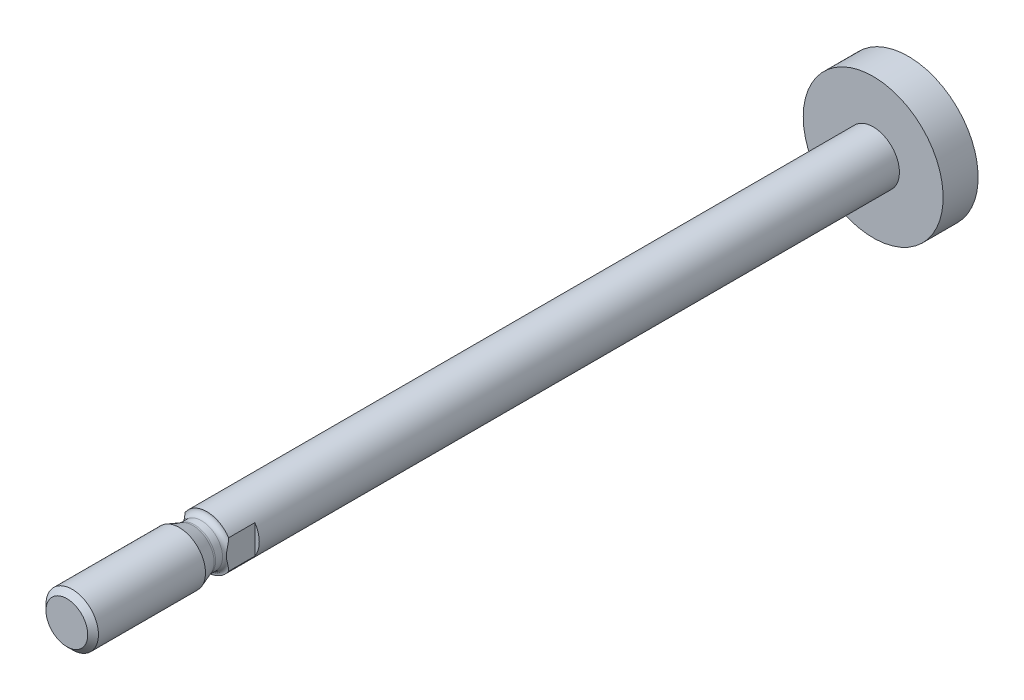
ISO-10303-21;
HEADER;
FILE_DESCRIPTION(('STEP AP214'),'2;1');
FILE_NAME('part.step','',(''),(''),'','','');
FILE_SCHEMA(('AUTOMOTIVE_DESIGN { 1 0 10303 214 1 1 1 1 }'));
ENDSEC;
DATA;
#1=APPLICATION_CONTEXT('core data for automotive mechanical design processes');
#2=APPLICATION_PROTOCOL_DEFINITION('international standard','automotive_design',2000,#1);
#3=PRODUCT_CONTEXT('',#1,'mechanical');
#4=PRODUCT('Part','Part','',(#3));
#5=PRODUCT_RELATED_PRODUCT_CATEGORY('part','',(#4));
#6=PRODUCT_DEFINITION_FORMATION('','',#4);
#7=PRODUCT_DEFINITION_CONTEXT('part definition',#1,'design');
#8=PRODUCT_DEFINITION('design','',#6,#7);
#9=PRODUCT_DEFINITION_SHAPE('','',#8);
#10=(LENGTH_UNIT() NAMED_UNIT(*) SI_UNIT(.MILLI.,.METRE.));
#11=(NAMED_UNIT(*) PLANE_ANGLE_UNIT() SI_UNIT($,.RADIAN.));
#12=(NAMED_UNIT(*) SI_UNIT($,.STERADIAN.) SOLID_ANGLE_UNIT());
#13=UNCERTAINTY_MEASURE_WITH_UNIT(LENGTH_MEASURE(1.E-05),#10,'distance_accuracy_value','');
#14=(GEOMETRIC_REPRESENTATION_CONTEXT(3) GLOBAL_UNCERTAINTY_ASSIGNED_CONTEXT((#13)) GLOBAL_UNIT_ASSIGNED_CONTEXT((#10,
#11,#12)) REPRESENTATION_CONTEXT('',''));
#15=CARTESIAN_POINT('',(0.,0.,0.));
#16=DIRECTION('',(0.,0.,1.));
#17=DIRECTION('',(1.,0.,0.));
#18=AXIS2_PLACEMENT_3D('',#15,#16,#17);
#19=CARTESIAN_POINT('',(0.,0.,-75.2));
#20=DIRECTION('',(0.,0.,-1.));
#21=DIRECTION('',(-1.,0.,0.));
#22=AXIS2_PLACEMENT_3D('',#19,#20,#21);
#23=CYLINDRICAL_SURFACE('',#22,3.);
#24=CARTESIAN_POINT('',(0.,0.,-71.2));
#25=DIRECTION('',(0.,0.,-1.));
#26=DIRECTION('',(-1.,0.,0.));
#27=AXIS2_PLACEMENT_3D('',#24,#25,#26);
#28=CIRCLE('',#27,3.);
#29=CARTESIAN_POINT('',(-3.,0.,-71.2));
#30=VERTEX_POINT('',#29);
#31=EDGE_CURVE('E80',#30,#30,#28,.T.);
#32=ORIENTED_EDGE('',*,*,#31,.F.);
#33=EDGE_LOOP('',(#32));
#34=FACE_BOUND('',#33,.T.);
#35=DIRECTION('',(0.,0.,-1.));
#36=VECTOR('',#35,1.);
#37=CARTESIAN_POINT('',(-2.5,1.6583123951777,4.99999999999909));
#38=LINE('',#37,#36);
#39=CARTESIAN_POINT('',(-2.5,1.65831239517778,4.99999999999909));
#40=VERTEX_POINT('',#39);
#41=CARTESIAN_POINT('',(-2.5,1.6583123951777,2.));
#42=VERTEX_POINT('',#41);
#43=EDGE_CURVE('E69',#40,#42,#38,.T.);
#44=ORIENTED_EDGE('',*,*,#43,.F.);
#45=CARTESIAN_POINT('',(0.,0.,5.));
#46=DIRECTION('',(0.,0.,-1.));
#47=DIRECTION('',(-0.833333333333321,0.552770798392585,0.));
#48=AXIS2_PLACEMENT_3D('',#45,#46,#47);
#49=CIRCLE('',#48,3.);
#50=CARTESIAN_POINT('',(2.5,1.6583123951777,5.));
#51=VERTEX_POINT('',#50);
#52=EDGE_CURVE('E55',#40,#51,#49,.T.);
#53=ORIENTED_EDGE('',*,*,#52,.T.);
#54=DIRECTION('',(0.,0.,1.));
#55=VECTOR('',#54,1.);
#56=CARTESIAN_POINT('',(2.5,1.6583123951777,2.));
#57=LINE('',#56,#55);
#58=CARTESIAN_POINT('',(2.5,1.6583123951777,2.));
#59=VERTEX_POINT('',#58);
#60=EDGE_CURVE('E68',#59,#51,#57,.T.);
#61=ORIENTED_EDGE('',*,*,#60,.F.);
#62=CARTESIAN_POINT('',(0.,0.,2.));
#63=DIRECTION('',(0.,0.,1.));
#64=DIRECTION('',(0.833333333333333,-0.552770798392567,0.));
#65=AXIS2_PLACEMENT_3D('',#62,#63,#64);
#66=CIRCLE('',#65,3.);
#67=CARTESIAN_POINT('',(2.5,-1.6583123951777,2.));
#68=VERTEX_POINT('',#67);
#69=EDGE_CURVE('E90',#68,#59,#66,.T.);
#70=ORIENTED_EDGE('',*,*,#69,.F.);
#71=DIRECTION('',(0.,0.,-1.));
#72=VECTOR('',#71,1.);
#73=CARTESIAN_POINT('',(2.5,-1.6583123951777,4.99999999999909));
#74=LINE('',#73,#72);
#75=CARTESIAN_POINT('',(2.5,-1.65831239517778,4.99999999999909));
#76=VERTEX_POINT('',#75);
#77=EDGE_CURVE('E94',#76,#68,#74,.T.);
#78=ORIENTED_EDGE('',*,*,#77,.F.);
#79=CARTESIAN_POINT('',(0.,0.,5.));
#80=DIRECTION('',(0.,0.,-1.));
#81=DIRECTION('',(0.833333333333321,-0.552770798392585,0.));
#82=AXIS2_PLACEMENT_3D('',#79,#80,#81);
#83=CIRCLE('',#82,3.);
#84=CARTESIAN_POINT('',(-2.5,-1.6583123951777,5.));
#85=VERTEX_POINT('',#84);
#86=EDGE_CURVE('E99',#76,#85,#83,.T.);
#87=ORIENTED_EDGE('',*,*,#86,.T.);
#88=DIRECTION('',(0.,0.,1.));
#89=VECTOR('',#88,1.);
#90=CARTESIAN_POINT('',(-2.5,-1.6583123951777,2.));
#91=LINE('',#90,#89);
#92=CARTESIAN_POINT('',(-2.5,-1.6583123951777,2.));
#93=VERTEX_POINT('',#92);
#94=EDGE_CURVE('E77',#93,#85,#91,.T.);
#95=ORIENTED_EDGE('',*,*,#94,.F.);
#96=CARTESIAN_POINT('',(0.,0.,2.));
#97=DIRECTION('',(0.,0.,1.));
#98=DIRECTION('',(-0.833333333333333,0.552770798392567,0.));
#99=AXIS2_PLACEMENT_3D('',#96,#97,#98);
#100=CIRCLE('',#99,3.);
#101=EDGE_CURVE('E34',#42,#93,#100,.T.);
#102=ORIENTED_EDGE('',*,*,#101,.F.);
#103=EDGE_LOOP('',(#44,#53,#61,#70,#78,#87,#95,#102));
#104=FACE_BOUND('',#103,.T.);
#105=ADVANCED_FACE('F17',(#34,#104),#23,.T.);
#106=CARTESIAN_POINT('',(0.,3.,-71.2));
#107=DIRECTION('',(0.,0.,-1.));
#108=DIRECTION('',(-1.,0.,0.));
#109=AXIS2_PLACEMENT_3D('',#106,#107,#108);
#110=PLANE('',#109);
#111=CARTESIAN_POINT('',(0.,0.,-71.2));
#112=DIRECTION('',(0.,0.,-1.));
#113=DIRECTION('',(-1.,0.,0.));
#114=AXIS2_PLACEMENT_3D('',#111,#112,#113);
#115=CIRCLE('',#114,8.);
#116=CARTESIAN_POINT('',(-8.,0.,-71.2));
#117=VERTEX_POINT('',#116);
#118=EDGE_CURVE('E109',#117,#117,#115,.T.);
#119=ORIENTED_EDGE('',*,*,#118,.F.);
#120=EDGE_LOOP('',(#119));
#121=FACE_BOUND('',#120,.T.);
#122=ORIENTED_EDGE('',*,*,#31,.T.);
#123=EDGE_LOOP('',(#122));
#124=FACE_BOUND('',#123,.T.);
#125=ADVANCED_FACE('F119',(#121,#124),#110,.F.);
#126=CARTESIAN_POINT('',(-2.5,-5.,6.));
#127=DIRECTION('',(-1.,0.,0.));
#128=DIRECTION('',(0.,0.,1.));
#129=AXIS2_PLACEMENT_3D('',#126,#127,#128);
#130=PLANE('',#129);
#131=ORIENTED_EDGE('',*,*,#43,.T.);
#132=DIRECTION('',(0.,1.,0.));
#133=VECTOR('',#132,1.);
#134=CARTESIAN_POINT('',(-2.5,-1.6583123951777,2.));
#135=LINE('',#134,#133);
#136=EDGE_CURVE('E31',#93,#42,#135,.T.);
#137=ORIENTED_EDGE('',*,*,#136,.F.);
#138=ORIENTED_EDGE('',*,*,#94,.T.);
#139=CARTESIAN_POINT('',(-2.5,-1.65831829169541,5.00000000000885));
#140=CARTESIAN_POINT('',(-2.5,-1.63491532877898,4.99999992973286));
#141=CARTESIAN_POINT('',(-2.5,-1.61149482046343,5.00041875125078));
#142=CARTESIAN_POINT('',(-2.5,-1.45329985222676,5.00583269208804));
#143=CARTESIAN_POINT('',(-2.5,-1.32008048780736,5.02291400118435));
#144=CARTESIAN_POINT('',(-2.5,-1.05526955750932,5.07061231229032));
#145=CARTESIAN_POINT('',(-2.5,-0.924587612317244,5.10126759833291));
#146=CARTESIAN_POINT('',(-2.5,-0.663403044787274,5.16510709196525));
#147=CARTESIAN_POINT('',(-2.5,-0.532955207719693,5.19852985989759));
#148=CARTESIAN_POINT('',(-2.5,-0.3351050647231,5.2375995275498));
#149=CARTESIAN_POINT('',(-2.5,-0.269167347488754,5.24862076501824));
#150=CARTESIAN_POINT('',(-2.5,-0.135243346078244,5.26407313721784));
#151=CARTESIAN_POINT('',(-2.5,-0.0659370163481887,5.26833752096453));
#152=CARTESIAN_POINT('',(-2.5,0.105328995263471,5.26833752096453));
#153=CARTESIAN_POINT('',(-2.5,0.204452731333742,5.25835623262265));
#154=CARTESIAN_POINT('',(-2.5,0.406625741882635,5.22538789194667));
#155=CARTESIAN_POINT('',(-2.5,0.506215999796735,5.20297777521126));
#156=CARTESIAN_POINT('',(-2.5,0.779290928519066,5.1376308856199));
#157=CARTESIAN_POINT('',(-2.5,0.952215632476059,5.09230978675975));
#158=CARTESIAN_POINT('',(-2.5,1.30286487229559,5.02381276997557));
#159=CARTESIAN_POINT('',(-2.5,1.47927159521248,4.9999999503834));
#160=CARTESIAN_POINT('',(-2.5,1.65831293934871,5.00000000000008));
#161=B_SPLINE_CURVE_WITH_KNOTS('',3,(#139,#140,#141,#142,#143,#144,#145,#146,#147,#148,#149,
#150,#151,#152,#153,#154,#155,#156,#157,#158,#159,#160),.UNSPECIFIED.,.F.,.F.,(4,2,2,2,2,2,2,2,
2,2,4),(9.64041016296276,9.70681215541733,10.0900053470554,10.4731985386934,10.8564820300666,
11.0481237757532,11.2397655214398,11.5458975492694,11.852029577099,12.3859060442365,
12.919782511374),.UNSPECIFIED.);
#162=EDGE_CURVE('E60',#85,#40,#161,.T.);
#163=ORIENTED_EDGE('',*,*,#162,.T.);
#164=EDGE_LOOP('',(#131,#137,#138,#163));
#165=FACE_BOUND('',#164,.T.);
#166=ADVANCED_FACE('F75',(#165),#130,.T.);
#167=CARTESIAN_POINT('',(0.,0.,5.6000000000001));
#168=DIRECTION('',(0.,0.,-1.));
#169=DIRECTION('',(-1.,0.,0.));
#170=AXIS2_PLACEMENT_3D('',#167,#168,#169);
#171=TOROIDAL_SURFACE('',#170,3.0000000000001,0.600000000000099);
#172=ORIENTED_EDGE('',*,*,#52,.F.);
#173=ORIENTED_EDGE('',*,*,#162,.F.);
#174=ORIENTED_EDGE('',*,*,#86,.F.);
#175=CARTESIAN_POINT('',(2.5,1.65831829169541,5.00000000000885));
#176=CARTESIAN_POINT('',(2.5,1.63491532877898,4.99999992973286));
#177=CARTESIAN_POINT('',(2.5,1.61149482046343,5.00041875125078));
#178=CARTESIAN_POINT('',(2.5,1.45329985222676,5.00583269208804));
#179=CARTESIAN_POINT('',(2.5,1.32008048780736,5.02291400118435));
#180=CARTESIAN_POINT('',(2.5,1.05526955750931,5.07061231229032));
#181=CARTESIAN_POINT('',(2.5,0.924587612317241,5.10126759833291));
#182=CARTESIAN_POINT('',(2.5,0.663403044787271,5.16510709196525));
#183=CARTESIAN_POINT('',(2.5,0.532955207719693,5.19852985989759));
#184=CARTESIAN_POINT('',(2.5,0.335105064723101,5.2375995275498));
#185=CARTESIAN_POINT('',(2.5,0.269167347488754,5.24862076501824));
#186=CARTESIAN_POINT('',(2.5,0.135243346078244,5.26407313721784));
#187=CARTESIAN_POINT('',(2.5,0.065937016348187,5.26833752096453));
#188=CARTESIAN_POINT('',(2.5,-0.105328995263471,5.26833752096453));
#189=CARTESIAN_POINT('',(2.5,-0.204452731333741,5.25835623262266));
#190=CARTESIAN_POINT('',(2.5,-0.406625741882635,5.22538789194667));
#191=CARTESIAN_POINT('',(2.5,-0.506215999796737,5.20297777521126));
#192=CARTESIAN_POINT('',(2.5,-0.779290928519067,5.1376308856199));
#193=CARTESIAN_POINT('',(2.5,-0.95221563247606,5.09230978675975));
#194=CARTESIAN_POINT('',(2.5,-1.30286487229559,5.02381276997557));
#195=CARTESIAN_POINT('',(2.5,-1.47927159521248,4.9999999503834));
#196=CARTESIAN_POINT('',(2.5,-1.65831293934871,5.00000000000008));
#197=B_SPLINE_CURVE_WITH_KNOTS('',3,(#175,#176,#177,#178,#179,#180,#181,#182,#183,#184,#185,
#186,#187,#188,#189,#190,#191,#192,#193,#194,#195,#196),.UNSPECIFIED.,.F.,.F.,(4,2,2,2,2,2,2,2,
2,2,4),(9.64041016296277,9.70681215541734,10.0900053470554,10.4731985386934,10.8564820300666,
11.0481237757532,11.2397655214398,11.5458975492694,11.852029577099,12.3859060442365,
12.9197825113741),.UNSPECIFIED.);
#198=EDGE_CURVE('E63',#51,#76,#197,.T.);
#199=ORIENTED_EDGE('',*,*,#198,.F.);
#200=EDGE_LOOP('',(#172,#173,#174,#199));
#201=FACE_BOUND('',#200,.T.);
#202=CARTESIAN_POINT('',(0.,0.,5.6));
#203=DIRECTION('',(0.,0.,-1.));
#204=DIRECTION('',(-1.,0.,0.));
#205=AXIS2_PLACEMENT_3D('',#202,#203,#204);
#206=CIRCLE('',#205,2.4);
#207=CARTESIAN_POINT('',(-2.4,0.,5.6));
#208=VERTEX_POINT('',#207);
#209=EDGE_CURVE('E155',#208,#208,#206,.T.);
#210=ORIENTED_EDGE('',*,*,#209,.T.);
#211=EDGE_LOOP('',(#210));
#212=FACE_BOUND('',#211,.T.);
#213=ADVANCED_FACE('F57',(#201,#212),#171,.F.);
#214=CARTESIAN_POINT('',(2.5,5.,6.));
#215=DIRECTION('',(1.,0.,0.));
#216=DIRECTION('',(0.,0.,-1.));
#217=AXIS2_PLACEMENT_3D('',#214,#215,#216);
#218=PLANE('',#217);
#219=ORIENTED_EDGE('',*,*,#77,.T.);
#220=DIRECTION('',(0.,-1.,0.));
#221=VECTOR('',#220,1.);
#222=CARTESIAN_POINT('',(2.5,1.6583123951777,2.));
#223=LINE('',#222,#221);
#224=EDGE_CURVE('E163',#59,#68,#223,.T.);
#225=ORIENTED_EDGE('',*,*,#224,.F.);
#226=ORIENTED_EDGE('',*,*,#60,.T.);
#227=ORIENTED_EDGE('',*,*,#198,.T.);
#228=EDGE_LOOP('',(#219,#225,#226,#227));
#229=FACE_BOUND('',#228,.T.);
#230=ADVANCED_FACE('F175',(#229),#218,.T.);
#231=CARTESIAN_POINT('',(0.,0.,2.));
#232=DIRECTION('',(0.,0.,1.));
#233=DIRECTION('',(1.,0.,0.));
#234=AXIS2_PLACEMENT_3D('',#231,#232,#233);
#235=PLANE('',#234);
#236=ORIENTED_EDGE('',*,*,#69,.T.);
#237=ORIENTED_EDGE('',*,*,#224,.T.);
#238=EDGE_LOOP('',(#236,#237));
#239=FACE_BOUND('',#238,.T.);
#240=ADVANCED_FACE('F184',(#239),#235,.T.);
#241=ORIENTED_EDGE('',*,*,#101,.T.);
#242=ORIENTED_EDGE('',*,*,#136,.T.);
#243=EDGE_LOOP('',(#241,#242));
#244=FACE_BOUND('',#243,.T.);
#245=ADVANCED_FACE('F187',(#244),#235,.T.);
#246=CARTESIAN_POINT('',(0.,0.,-75.2));
#247=DIRECTION('',(0.,0.,-1.));
#248=DIRECTION('',(-1.,0.,0.));
#249=AXIS2_PLACEMENT_3D('',#246,#247,#248);
#250=CYLINDRICAL_SURFACE('',#249,8.);
#251=CARTESIAN_POINT('',(0.,0.,-75.2));
#252=DIRECTION('',(0.,0.,-1.));
#253=DIRECTION('',(-1.,0.,0.));
#254=AXIS2_PLACEMENT_3D('',#251,#252,#253);
#255=CIRCLE('',#254,8.);
#256=CARTESIAN_POINT('',(-8.,0.,-75.2));
#257=VERTEX_POINT('',#256);
#258=EDGE_CURVE('E165',#257,#257,#255,.T.);
#259=ORIENTED_EDGE('',*,*,#258,.F.);
#260=EDGE_LOOP('',(#259));
#261=FACE_BOUND('',#260,.T.);
#262=ORIENTED_EDGE('',*,*,#118,.T.);
#263=EDGE_LOOP('',(#262));
#264=FACE_BOUND('',#263,.T.);
#265=ADVANCED_FACE('F117',(#261,#264),#250,.T.);
#266=CARTESIAN_POINT('',(0.,0.,4.));
#267=DIRECTION('',(0.,0.,-1.));
#268=DIRECTION('',(-1.,0.,0.));
#269=AXIS2_PLACEMENT_3D('',#266,#267,#268);
#270=CYLINDRICAL_SURFACE('',#269,2.4);
#271=ORIENTED_EDGE('',*,*,#209,.F.);
#272=EDGE_LOOP('',(#271));
#273=FACE_BOUND('',#272,.T.);
#274=CARTESIAN_POINT('',(0.,0.,6.3942038115749));
#275=DIRECTION('',(0.,0.,-1.));
#276=DIRECTION('',(-1.,0.,0.));
#277=AXIS2_PLACEMENT_3D('',#274,#275,#276);
#278=CIRCLE('',#277,2.4);
#279=CARTESIAN_POINT('',(-2.4,0.,6.3942038115749));
#280=VERTEX_POINT('',#279);
#281=EDGE_CURVE('E229',#280,#280,#278,.T.);
#282=ORIENTED_EDGE('',*,*,#281,.T.);
#283=EDGE_LOOP('',(#282));
#284=FACE_BOUND('',#283,.T.);
#285=ADVANCED_FACE('F191',(#273,#284),#270,.T.);
#286=CARTESIAN_POINT('',(0.,8.,-75.2));
#287=DIRECTION('',(0.,0.,1.));
#288=DIRECTION('',(1.,0.,0.));
#289=AXIS2_PLACEMENT_3D('',#286,#287,#288);
#290=PLANE('',#289);
#291=ORIENTED_EDGE('',*,*,#258,.T.);
#292=EDGE_LOOP('',(#291));
#293=FACE_BOUND('',#292,.T.);
#294=ADVANCED_FACE('F195',(#293),#290,.F.);
#295=CARTESIAN_POINT('',(0.,0.,6.39420381157483));
#296=DIRECTION('',(0.,0.,-1.));
#297=DIRECTION('',(-1.,0.,0.));
#298=AXIS2_PLACEMENT_3D('',#295,#296,#297);
#299=TOROIDAL_SURFACE('',#298,2.99999999999971,0.599999999999703);
#300=ORIENTED_EDGE('',*,*,#281,.F.);
#301=EDGE_LOOP('',(#300));
#302=FACE_BOUND('',#301,.T.);
#303=CARTESIAN_POINT('',(0.,0.,6.5994158975703));
#304=DIRECTION('',(0.,0.,-1.));
#305=DIRECTION('',(-1.,0.,0.));
#306=AXIS2_PLACEMENT_3D('',#303,#304,#305);
#307=CIRCLE('',#306,2.4361844275285);
#308=CARTESIAN_POINT('',(-2.4361844275285,0.,6.5994158975703));
#309=VERTEX_POINT('',#308);
#310=EDGE_CURVE('E225',#309,#309,#307,.T.);
#311=ORIENTED_EDGE('',*,*,#310,.T.);
#312=EDGE_LOOP('',(#311));
#313=FACE_BOUND('',#312,.T.);
#314=ADVANCED_FACE('F199',(#302,#313),#299,.F.);
#315=CARTESIAN_POINT('',(0.,0.,8.1484864516728));
#316=DIRECTION('',(0.,0.,1.));
#317=DIRECTION('',(1.,0.,0.));
#318=AXIS2_PLACEMENT_3D('',#315,#316,#317);
#319=CONICAL_SURFACE('',#318,3.,0.349065850398829);
#320=ORIENTED_EDGE('',*,*,#310,.F.);
#321=EDGE_LOOP('',(#320));
#322=FACE_BOUND('',#321,.T.);
#323=CARTESIAN_POINT('',(0.,0.,8.1484864516728));
#324=DIRECTION('',(0.,0.,-1.));
#325=DIRECTION('',(-1.,0.,0.));
#326=AXIS2_PLACEMENT_3D('',#323,#324,#325);
#327=CIRCLE('',#326,3.);
#328=CARTESIAN_POINT('',(-3.,0.,8.1484864516728));
#329=VERTEX_POINT('',#328);
#330=EDGE_CURVE('E223',#329,#329,#327,.T.);
#331=ORIENTED_EDGE('',*,*,#330,.T.);
#332=EDGE_LOOP('',(#331));
#333=FACE_BOUND('',#332,.T.);
#334=ADVANCED_FACE('F203',(#322,#333),#319,.T.);
#335=CARTESIAN_POINT('',(0.,0.,4.));
#336=DIRECTION('',(0.,0.,-1.));
#337=DIRECTION('',(-1.,0.,0.));
#338=AXIS2_PLACEMENT_3D('',#335,#336,#337);
#339=CYLINDRICAL_SURFACE('',#338,3.);
#340=ORIENTED_EDGE('',*,*,#330,.F.);
#341=EDGE_LOOP('',(#340));
#342=FACE_BOUND('',#341,.T.);
#343=CARTESIAN_POINT('',(0.,0.,20.3865));
#344=DIRECTION('',(0.,0.,-1.));
#345=DIRECTION('',(-1.,0.,0.));
#346=AXIS2_PLACEMENT_3D('',#343,#344,#345);
#347=CIRCLE('',#346,3.);
#348=CARTESIAN_POINT('',(-3.,0.,20.3865));
#349=VERTEX_POINT('',#348);
#350=EDGE_CURVE('E25',#349,#349,#347,.T.);
#351=ORIENTED_EDGE('',*,*,#350,.T.);
#352=EDGE_LOOP('',(#351));
#353=FACE_BOUND('',#352,.T.);
#354=ADVANCED_FACE('F207',(#342,#353),#339,.T.);
#355=CARTESIAN_POINT('',(0.,0.,21.));
#356=DIRECTION('',(0.,0.,-1.));
#357=DIRECTION('',(-1.,0.,0.));
#358=AXIS2_PLACEMENT_3D('',#355,#356,#357);
#359=CONICAL_SURFACE('',#358,2.3865,0.785398163397449);
#360=ORIENTED_EDGE('',*,*,#350,.F.);
#361=EDGE_LOOP('',(#360));
#362=FACE_BOUND('',#361,.T.);
#363=CARTESIAN_POINT('',(0.,0.,21.));
#364=DIRECTION('',(0.,0.,-1.));
#365=DIRECTION('',(-1.,0.,0.));
#366=AXIS2_PLACEMENT_3D('',#363,#364,#365);
#367=CIRCLE('',#366,2.3865);
#368=CARTESIAN_POINT('',(-2.3865,0.,21.));
#369=VERTEX_POINT('',#368);
#370=EDGE_CURVE('E11',#369,#369,#367,.T.);
#371=ORIENTED_EDGE('',*,*,#370,.T.);
#372=EDGE_LOOP('',(#371));
#373=FACE_BOUND('',#372,.T.);
#374=ADVANCED_FACE('F210',(#362,#373),#359,.T.);
#375=CARTESIAN_POINT('',(0.,0.,21.));
#376=DIRECTION('',(0.,0.,-1.));
#377=DIRECTION('',(-1.,0.,0.));
#378=AXIS2_PLACEMENT_3D('',#375,#376,#377);
#379=PLANE('',#378);
#380=ORIENTED_EDGE('',*,*,#370,.F.);
#381=EDGE_LOOP('',(#380));
#382=FACE_BOUND('',#381,.T.);
#383=ADVANCED_FACE('F19',(#382),#379,.F.);
#384=CLOSED_SHELL('',(#105,#125,#166,#213,#230,#240,#245,#265,#285,#294,#314,#334,#354,#374,#383));
#385=MANIFOLD_SOLID_BREP('B1',#384);
#386=ADVANCED_BREP_SHAPE_REPRESENTATION('',(#18,#385),#14);
#387=SHAPE_DEFINITION_REPRESENTATION(#9,#386);
ENDSEC;
END-ISO-10303-21;
